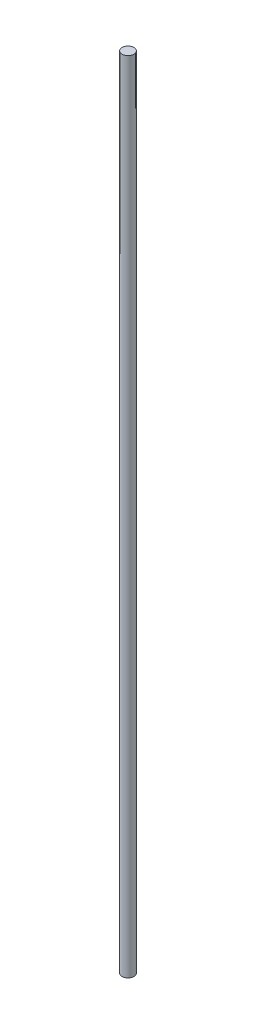
ISO-10303-21;
HEADER;
FILE_DESCRIPTION(('STEP AP214'),'2;1');
FILE_NAME('part.step','',(''),(''),'','','');
FILE_SCHEMA(('AUTOMOTIVE_DESIGN { 1 0 10303 214 1 1 1 1 }'));
ENDSEC;
DATA;
#1=APPLICATION_CONTEXT('core data for automotive mechanical design processes');
#2=APPLICATION_PROTOCOL_DEFINITION('international standard','automotive_design',2000,#1);
#3=PRODUCT_CONTEXT('',#1,'mechanical');
#4=PRODUCT('Part','Part','',(#3));
#5=PRODUCT_RELATED_PRODUCT_CATEGORY('part','',(#4));
#6=PRODUCT_DEFINITION_FORMATION('','',#4);
#7=PRODUCT_DEFINITION_CONTEXT('part definition',#1,'design');
#8=PRODUCT_DEFINITION('design','',#6,#7);
#9=PRODUCT_DEFINITION_SHAPE('','',#8);
#10=(LENGTH_UNIT() NAMED_UNIT(*) SI_UNIT(.MILLI.,.METRE.));
#11=(NAMED_UNIT(*) PLANE_ANGLE_UNIT() SI_UNIT($,.RADIAN.));
#12=(NAMED_UNIT(*) SI_UNIT($,.STERADIAN.) SOLID_ANGLE_UNIT());
#13=UNCERTAINTY_MEASURE_WITH_UNIT(LENGTH_MEASURE(1.E-05),#10,'distance_accuracy_value','');
#14=(GEOMETRIC_REPRESENTATION_CONTEXT(3) GLOBAL_UNCERTAINTY_ASSIGNED_CONTEXT((#13)) GLOBAL_UNIT_ASSIGNED_CONTEXT((#10,
#11,#12)) REPRESENTATION_CONTEXT('',''));
#15=CARTESIAN_POINT('',(0.,0.,0.));
#16=DIRECTION('',(0.,0.,1.));
#17=DIRECTION('',(1.,0.,0.));
#18=AXIS2_PLACEMENT_3D('',#15,#16,#17);
#19=CARTESIAN_POINT('',(0.,860.,0.));
#20=DIRECTION('',(0.,-1.,0.));
#21=DIRECTION('',(0.,0.,-1.));
#22=AXIS2_PLACEMENT_3D('',#19,#20,#21);
#23=CYLINDRICAL_SURFACE('',#22,6.35);
#24=CARTESIAN_POINT('',(0.,860.,0.));
#25=DIRECTION('',(0.,1.,0.));
#26=DIRECTION('',(0.,0.,1.));
#27=AXIS2_PLACEMENT_3D('',#24,#25,#26);
#28=CIRCLE('',#27,6.35);
#29=CARTESIAN_POINT('',(0.,860.,6.35));
#30=VERTEX_POINT('',#29);
#31=EDGE_CURVE('E10',#30,#30,#28,.T.);
#32=ORIENTED_EDGE('',*,*,#31,.F.);
#33=EDGE_LOOP('',(#32));
#34=FACE_BOUND('',#33,.T.);
#35=CARTESIAN_POINT('',(0.,0.,0.));
#36=DIRECTION('',(0.,1.,0.));
#37=DIRECTION('',(0.,0.,1.));
#38=AXIS2_PLACEMENT_3D('',#35,#36,#37);
#39=CIRCLE('',#38,6.35);
#40=CARTESIAN_POINT('',(0.,0.,6.35));
#41=VERTEX_POINT('',#40);
#42=EDGE_CURVE('E34',#41,#41,#39,.T.);
#43=ORIENTED_EDGE('',*,*,#42,.T.);
#44=EDGE_LOOP('',(#43));
#45=FACE_BOUND('',#44,.T.);
#46=ADVANCED_FACE('F31',(#34,#45),#23,.T.);
#47=CARTESIAN_POINT('',(0.,860.,0.));
#48=DIRECTION('',(0.,1.,0.));
#49=DIRECTION('',(0.,0.,1.));
#50=AXIS2_PLACEMENT_3D('',#47,#48,#49);
#51=PLANE('',#50);
#52=ORIENTED_EDGE('',*,*,#31,.T.);
#53=EDGE_LOOP('',(#52));
#54=FACE_BOUND('',#53,.T.);
#55=ADVANCED_FACE('F46',(#54),#51,.T.);
#56=CARTESIAN_POINT('',(0.,0.,0.));
#57=DIRECTION('',(0.,1.,0.));
#58=DIRECTION('',(0.,0.,1.));
#59=AXIS2_PLACEMENT_3D('',#56,#57,#58);
#60=PLANE('',#59);
#61=ORIENTED_EDGE('',*,*,#42,.F.);
#62=EDGE_LOOP('',(#61));
#63=FACE_BOUND('',#62,.T.);
#64=ADVANCED_FACE('F44',(#63),#60,.F.);
#65=CLOSED_SHELL('',(#46,#55,#64));
#66=MANIFOLD_SOLID_BREP('B2',#65);
#67=ADVANCED_BREP_SHAPE_REPRESENTATION('',(#18,#66),#14);
#68=SHAPE_DEFINITION_REPRESENTATION(#9,#67);
ENDSEC;
END-ISO-10303-21;
